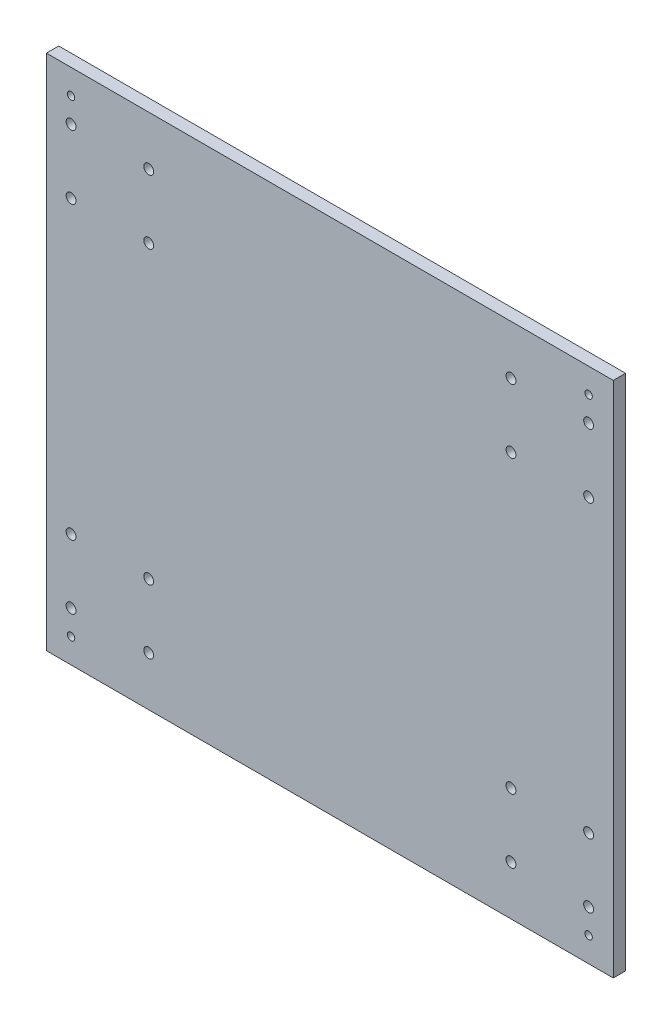
ISO-10303-21;
HEADER;
FILE_DESCRIPTION(('STEP AP214'),'2;1');
FILE_NAME('part.step','',(''),(''),'','','');
FILE_SCHEMA(('AUTOMOTIVE_DESIGN { 1 0 10303 214 1 1 1 1 }'));
ENDSEC;
DATA;
#1=APPLICATION_CONTEXT('core data for automotive mechanical design processes');
#2=APPLICATION_PROTOCOL_DEFINITION('international standard','automotive_design',2000,#1);
#3=PRODUCT_CONTEXT('',#1,'mechanical');
#4=PRODUCT('Part','Part','',(#3));
#5=PRODUCT_RELATED_PRODUCT_CATEGORY('part','',(#4));
#6=PRODUCT_DEFINITION_FORMATION('','',#4);
#7=PRODUCT_DEFINITION_CONTEXT('part definition',#1,'design');
#8=PRODUCT_DEFINITION('design','',#6,#7);
#9=PRODUCT_DEFINITION_SHAPE('','',#8);
#10=(LENGTH_UNIT() NAMED_UNIT(*) SI_UNIT(.MILLI.,.METRE.));
#11=(NAMED_UNIT(*) PLANE_ANGLE_UNIT() SI_UNIT($,.RADIAN.));
#12=(NAMED_UNIT(*) SI_UNIT($,.STERADIAN.) SOLID_ANGLE_UNIT());
#13=UNCERTAINTY_MEASURE_WITH_UNIT(LENGTH_MEASURE(1.E-05),#10,'distance_accuracy_value','');
#14=(GEOMETRIC_REPRESENTATION_CONTEXT(3) GLOBAL_UNCERTAINTY_ASSIGNED_CONTEXT((#13)) GLOBAL_UNIT_ASSIGNED_CONTEXT((#10,
#11,#12)) REPRESENTATION_CONTEXT('',''));
#15=CARTESIAN_POINT('',(0.,0.,0.));
#16=DIRECTION('',(0.,0.,1.));
#17=DIRECTION('',(1.,0.,0.));
#18=AXIS2_PLACEMENT_3D('',#15,#16,#17);
#19=CARTESIAN_POINT('',(0.,0.,5.));
#20=DIRECTION('',(0.,0.,-1.));
#21=DIRECTION('',(-1.,0.,0.));
#22=AXIS2_PLACEMENT_3D('',#19,#20,#21);
#23=PLANE('',#22);
#24=DIRECTION('',(0.,1.,0.));
#25=VECTOR('',#24,1.);
#26=CARTESIAN_POINT('',(115.,-105.,5.));
#27=LINE('',#26,#25);
#28=CARTESIAN_POINT('',(115.,-105.,5.));
#29=VERTEX_POINT('',#28);
#30=CARTESIAN_POINT('',(115.,105.,5.));
#31=VERTEX_POINT('',#30);
#32=EDGE_CURVE('E89',#29,#31,#27,.T.);
#33=ORIENTED_EDGE('',*,*,#32,.T.);
#34=DIRECTION('',(-1.,0.,0.));
#35=VECTOR('',#34,1.);
#36=CARTESIAN_POINT('',(-115.,105.,5.));
#37=LINE('',#36,#35);
#38=CARTESIAN_POINT('',(-115.,105.,5.));
#39=VERTEX_POINT('',#38);
#40=EDGE_CURVE('E84',#31,#39,#37,.T.);
#41=ORIENTED_EDGE('',*,*,#40,.T.);
#42=DIRECTION('',(0.,-1.,0.));
#43=VECTOR('',#42,1.);
#44=CARTESIAN_POINT('',(-115.,-105.,5.));
#45=LINE('',#44,#43);
#46=CARTESIAN_POINT('',(-115.,-105.,5.));
#47=VERTEX_POINT('',#46);
#48=EDGE_CURVE('E87',#39,#47,#45,.T.);
#49=ORIENTED_EDGE('',*,*,#48,.T.);
#50=DIRECTION('',(1.,0.,0.));
#51=VECTOR('',#50,1.);
#52=CARTESIAN_POINT('',(-115.,-105.,5.));
#53=LINE('',#52,#51);
#54=EDGE_CURVE('E54',#47,#29,#53,.T.);
#55=ORIENTED_EDGE('',*,*,#54,.T.);
#56=EDGE_LOOP('',(#33,#41,#49,#55));
#57=FACE_BOUND('',#56,.T.);
#58=CARTESIAN_POINT('',(-105.,85.,5.));
#59=DIRECTION('',(0.,0.,1.));
#60=DIRECTION('',(1.,0.,0.));
#61=AXIS2_PLACEMENT_3D('',#58,#59,#60);
#62=CIRCLE('',#61,2.);
#63=CARTESIAN_POINT('',(-103.,85.,5.));
#64=VERTEX_POINT('',#63);
#65=EDGE_CURVE('E104',#64,#64,#62,.T.);
#66=ORIENTED_EDGE('',*,*,#65,.F.);
#67=EDGE_LOOP('',(#66));
#68=FACE_BOUND('',#67,.T.);
#69=CARTESIAN_POINT('',(-73.5,85.,5.));
#70=DIRECTION('',(0.,0.,1.));
#71=DIRECTION('',(1.,0.,0.));
#72=AXIS2_PLACEMENT_3D('',#69,#70,#71);
#73=CIRCLE('',#72,2.);
#74=CARTESIAN_POINT('',(-71.5,85.,5.));
#75=VERTEX_POINT('',#74);
#76=EDGE_CURVE('E119',#75,#75,#73,.T.);
#77=ORIENTED_EDGE('',*,*,#76,.F.);
#78=EDGE_LOOP('',(#77));
#79=FACE_BOUND('',#78,.T.);
#80=CARTESIAN_POINT('',(-105.,59.,5.));
#81=DIRECTION('',(0.,0.,1.));
#82=DIRECTION('',(1.,0.,0.));
#83=AXIS2_PLACEMENT_3D('',#80,#81,#82);
#84=CIRCLE('',#83,2.);
#85=CARTESIAN_POINT('',(-103.,59.,5.));
#86=VERTEX_POINT('',#85);
#87=EDGE_CURVE('E125',#86,#86,#84,.T.);
#88=ORIENTED_EDGE('',*,*,#87,.F.);
#89=EDGE_LOOP('',(#88));
#90=FACE_BOUND('',#89,.T.);
#91=CARTESIAN_POINT('',(-73.5,59.,5.));
#92=DIRECTION('',(0.,0.,1.));
#93=DIRECTION('',(1.,0.,0.));
#94=AXIS2_PLACEMENT_3D('',#91,#92,#93);
#95=CIRCLE('',#94,2.);
#96=CARTESIAN_POINT('',(-71.5,59.,5.));
#97=VERTEX_POINT('',#96);
#98=EDGE_CURVE('E131',#97,#97,#95,.T.);
#99=ORIENTED_EDGE('',*,*,#98,.F.);
#100=EDGE_LOOP('',(#99));
#101=FACE_BOUND('',#100,.T.);
#102=CARTESIAN_POINT('',(-105.,95.,5.));
#103=DIRECTION('',(0.,0.,1.));
#104=DIRECTION('',(1.,0.,0.));
#105=AXIS2_PLACEMENT_3D('',#102,#103,#104);
#106=CIRCLE('',#105,1.5);
#107=CARTESIAN_POINT('',(-103.5,95.,5.));
#108=VERTEX_POINT('',#107);
#109=EDGE_CURVE('E137',#108,#108,#106,.T.);
#110=ORIENTED_EDGE('',*,*,#109,.F.);
#111=EDGE_LOOP('',(#110));
#112=FACE_BOUND('',#111,.T.);
#113=CARTESIAN_POINT('',(-105.,-59.,5.));
#114=DIRECTION('',(0.,0.,1.));
#115=DIRECTION('',(-1.,0.,0.));
#116=AXIS2_PLACEMENT_3D('',#113,#114,#115);
#117=CIRCLE('',#116,2.);
#118=CARTESIAN_POINT('',(-107.,-59.,5.));
#119=VERTEX_POINT('',#118);
#120=EDGE_CURVE('E143',#119,#119,#117,.T.);
#121=ORIENTED_EDGE('',*,*,#120,.F.);
#122=EDGE_LOOP('',(#121));
#123=FACE_BOUND('',#122,.T.);
#124=CARTESIAN_POINT('',(-105.,-85.,5.));
#125=DIRECTION('',(0.,0.,1.));
#126=DIRECTION('',(-1.,0.,0.));
#127=AXIS2_PLACEMENT_3D('',#124,#125,#126);
#128=CIRCLE('',#127,2.);
#129=CARTESIAN_POINT('',(-107.,-85.,5.));
#130=VERTEX_POINT('',#129);
#131=EDGE_CURVE('E149',#130,#130,#128,.T.);
#132=ORIENTED_EDGE('',*,*,#131,.F.);
#133=EDGE_LOOP('',(#132));
#134=FACE_BOUND('',#133,.T.);
#135=CARTESIAN_POINT('',(-105.,-95.,5.));
#136=DIRECTION('',(0.,0.,1.));
#137=DIRECTION('',(-1.,0.,0.));
#138=AXIS2_PLACEMENT_3D('',#135,#136,#137);
#139=CIRCLE('',#138,1.5);
#140=CARTESIAN_POINT('',(-106.5,-95.,5.));
#141=VERTEX_POINT('',#140);
#142=EDGE_CURVE('E155',#141,#141,#139,.T.);
#143=ORIENTED_EDGE('',*,*,#142,.F.);
#144=EDGE_LOOP('',(#143));
#145=FACE_BOUND('',#144,.T.);
#146=CARTESIAN_POINT('',(-73.5,-59.,5.));
#147=DIRECTION('',(0.,0.,1.));
#148=DIRECTION('',(-1.,0.,0.));
#149=AXIS2_PLACEMENT_3D('',#146,#147,#148);
#150=CIRCLE('',#149,2.);
#151=CARTESIAN_POINT('',(-75.5,-59.,5.));
#152=VERTEX_POINT('',#151);
#153=EDGE_CURVE('E161',#152,#152,#150,.T.);
#154=ORIENTED_EDGE('',*,*,#153,.F.);
#155=EDGE_LOOP('',(#154));
#156=FACE_BOUND('',#155,.T.);
#157=CARTESIAN_POINT('',(-73.5,-85.,5.));
#158=DIRECTION('',(0.,0.,1.));
#159=DIRECTION('',(-1.,0.,0.));
#160=AXIS2_PLACEMENT_3D('',#157,#158,#159);
#161=CIRCLE('',#160,2.);
#162=CARTESIAN_POINT('',(-75.5,-85.,5.));
#163=VERTEX_POINT('',#162);
#164=EDGE_CURVE('E167',#163,#163,#161,.T.);
#165=ORIENTED_EDGE('',*,*,#164,.F.);
#166=EDGE_LOOP('',(#165));
#167=FACE_BOUND('',#166,.T.);
#168=CARTESIAN_POINT('',(73.5,-85.,5.));
#169=DIRECTION('',(0.,0.,1.));
#170=DIRECTION('',(1.,0.,0.));
#171=AXIS2_PLACEMENT_3D('',#168,#169,#170);
#172=CIRCLE('',#171,2.);
#173=CARTESIAN_POINT('',(75.5,-85.,5.));
#174=VERTEX_POINT('',#173);
#175=EDGE_CURVE('E173',#174,#174,#172,.T.);
#176=ORIENTED_EDGE('',*,*,#175,.F.);
#177=EDGE_LOOP('',(#176));
#178=FACE_BOUND('',#177,.T.);
#179=CARTESIAN_POINT('',(73.5,-59.,5.));
#180=DIRECTION('',(0.,0.,1.));
#181=DIRECTION('',(1.,0.,0.));
#182=AXIS2_PLACEMENT_3D('',#179,#180,#181);
#183=CIRCLE('',#182,2.);
#184=CARTESIAN_POINT('',(75.5,-59.,5.));
#185=VERTEX_POINT('',#184);
#186=EDGE_CURVE('E179',#185,#185,#183,.T.);
#187=ORIENTED_EDGE('',*,*,#186,.F.);
#188=EDGE_LOOP('',(#187));
#189=FACE_BOUND('',#188,.T.);
#190=CARTESIAN_POINT('',(105.,-95.,5.));
#191=DIRECTION('',(0.,0.,1.));
#192=DIRECTION('',(1.,0.,0.));
#193=AXIS2_PLACEMENT_3D('',#190,#191,#192);
#194=CIRCLE('',#193,1.5);
#195=CARTESIAN_POINT('',(106.5,-95.,5.));
#196=VERTEX_POINT('',#195);
#197=EDGE_CURVE('E185',#196,#196,#194,.T.);
#198=ORIENTED_EDGE('',*,*,#197,.F.);
#199=EDGE_LOOP('',(#198));
#200=FACE_BOUND('',#199,.T.);
#201=CARTESIAN_POINT('',(105.,-85.,5.));
#202=DIRECTION('',(0.,0.,1.));
#203=DIRECTION('',(1.,0.,0.));
#204=AXIS2_PLACEMENT_3D('',#201,#202,#203);
#205=CIRCLE('',#204,2.);
#206=CARTESIAN_POINT('',(107.,-85.,5.));
#207=VERTEX_POINT('',#206);
#208=EDGE_CURVE('E191',#207,#207,#205,.T.);
#209=ORIENTED_EDGE('',*,*,#208,.F.);
#210=EDGE_LOOP('',(#209));
#211=FACE_BOUND('',#210,.T.);
#212=CARTESIAN_POINT('',(105.,-59.,5.));
#213=DIRECTION('',(0.,0.,1.));
#214=DIRECTION('',(1.,0.,0.));
#215=AXIS2_PLACEMENT_3D('',#212,#213,#214);
#216=CIRCLE('',#215,2.);
#217=CARTESIAN_POINT('',(107.,-59.,5.));
#218=VERTEX_POINT('',#217);
#219=EDGE_CURVE('E197',#218,#218,#216,.T.);
#220=ORIENTED_EDGE('',*,*,#219,.F.);
#221=EDGE_LOOP('',(#220));
#222=FACE_BOUND('',#221,.T.);
#223=CARTESIAN_POINT('',(105.,95.,5.));
#224=DIRECTION('',(0.,0.,1.));
#225=DIRECTION('',(-1.,0.,0.));
#226=AXIS2_PLACEMENT_3D('',#223,#224,#225);
#227=CIRCLE('',#226,1.5);
#228=CARTESIAN_POINT('',(103.5,95.,5.));
#229=VERTEX_POINT('',#228);
#230=EDGE_CURVE('E203',#229,#229,#227,.T.);
#231=ORIENTED_EDGE('',*,*,#230,.F.);
#232=EDGE_LOOP('',(#231));
#233=FACE_BOUND('',#232,.T.);
#234=CARTESIAN_POINT('',(73.5,59.,5.));
#235=DIRECTION('',(0.,0.,1.));
#236=DIRECTION('',(-1.,0.,0.));
#237=AXIS2_PLACEMENT_3D('',#234,#235,#236);
#238=CIRCLE('',#237,2.);
#239=CARTESIAN_POINT('',(71.5,59.,5.));
#240=VERTEX_POINT('',#239);
#241=EDGE_CURVE('E209',#240,#240,#238,.T.);
#242=ORIENTED_EDGE('',*,*,#241,.F.);
#243=EDGE_LOOP('',(#242));
#244=FACE_BOUND('',#243,.T.);
#245=CARTESIAN_POINT('',(105.,59.,5.));
#246=DIRECTION('',(0.,0.,1.));
#247=DIRECTION('',(-1.,0.,0.));
#248=AXIS2_PLACEMENT_3D('',#245,#246,#247);
#249=CIRCLE('',#248,2.);
#250=CARTESIAN_POINT('',(103.,59.,5.));
#251=VERTEX_POINT('',#250);
#252=EDGE_CURVE('E215',#251,#251,#249,.T.);
#253=ORIENTED_EDGE('',*,*,#252,.F.);
#254=EDGE_LOOP('',(#253));
#255=FACE_BOUND('',#254,.T.);
#256=CARTESIAN_POINT('',(73.5,85.,5.));
#257=DIRECTION('',(0.,0.,1.));
#258=DIRECTION('',(-1.,0.,0.));
#259=AXIS2_PLACEMENT_3D('',#256,#257,#258);
#260=CIRCLE('',#259,2.);
#261=CARTESIAN_POINT('',(71.5,85.,5.));
#262=VERTEX_POINT('',#261);
#263=EDGE_CURVE('E221',#262,#262,#260,.T.);
#264=ORIENTED_EDGE('',*,*,#263,.F.);
#265=EDGE_LOOP('',(#264));
#266=FACE_BOUND('',#265,.T.);
#267=CARTESIAN_POINT('',(105.,85.,5.));
#268=DIRECTION('',(0.,0.,1.));
#269=DIRECTION('',(-1.,0.,0.));
#270=AXIS2_PLACEMENT_3D('',#267,#268,#269);
#271=CIRCLE('',#270,2.);
#272=CARTESIAN_POINT('',(103.,85.,5.));
#273=VERTEX_POINT('',#272);
#274=EDGE_CURVE('E227',#273,#273,#271,.T.);
#275=ORIENTED_EDGE('',*,*,#274,.F.);
#276=EDGE_LOOP('',(#275));
#277=FACE_BOUND('',#276,.T.);
#278=ADVANCED_FACE('F37',(#57,#68,#79,#90,#101,#112,#123,#134,#145,#156,#167,#178,#189,#200,
#211,#222,#233,#244,#255,#266,#277),#23,.F.);
#279=CARTESIAN_POINT('',(0.,0.,0.));
#280=DIRECTION('',(0.,0.,-1.));
#281=DIRECTION('',(-1.,0.,0.));
#282=AXIS2_PLACEMENT_3D('',#279,#280,#281);
#283=PLANE('',#282);
#284=CARTESIAN_POINT('',(73.5,85.,0.));
#285=DIRECTION('',(0.,0.,1.));
#286=DIRECTION('',(-1.,0.,0.));
#287=AXIS2_PLACEMENT_3D('',#284,#285,#286);
#288=CIRCLE('',#287,2.);
#289=CARTESIAN_POINT('',(71.5,85.,0.));
#290=VERTEX_POINT('',#289);
#291=EDGE_CURVE('E224',#290,#290,#288,.T.);
#292=ORIENTED_EDGE('',*,*,#291,.T.);
#293=EDGE_LOOP('',(#292));
#294=FACE_BOUND('',#293,.T.);
#295=CARTESIAN_POINT('',(73.5,59.,0.));
#296=DIRECTION('',(0.,0.,1.));
#297=DIRECTION('',(-1.,0.,0.));
#298=AXIS2_PLACEMENT_3D('',#295,#296,#297);
#299=CIRCLE('',#298,2.);
#300=CARTESIAN_POINT('',(71.5,59.,0.));
#301=VERTEX_POINT('',#300);
#302=EDGE_CURVE('E212',#301,#301,#299,.T.);
#303=ORIENTED_EDGE('',*,*,#302,.T.);
#304=EDGE_LOOP('',(#303));
#305=FACE_BOUND('',#304,.T.);
#306=CARTESIAN_POINT('',(105.,-59.,0.));
#307=DIRECTION('',(0.,0.,1.));
#308=DIRECTION('',(1.,0.,0.));
#309=AXIS2_PLACEMENT_3D('',#306,#307,#308);
#310=CIRCLE('',#309,2.);
#311=CARTESIAN_POINT('',(107.,-59.,0.));
#312=VERTEX_POINT('',#311);
#313=EDGE_CURVE('E200',#312,#312,#310,.T.);
#314=ORIENTED_EDGE('',*,*,#313,.T.);
#315=EDGE_LOOP('',(#314));
#316=FACE_BOUND('',#315,.T.);
#317=CARTESIAN_POINT('',(105.,-95.,0.));
#318=DIRECTION('',(0.,0.,1.));
#319=DIRECTION('',(1.,0.,0.));
#320=AXIS2_PLACEMENT_3D('',#317,#318,#319);
#321=CIRCLE('',#320,1.5);
#322=CARTESIAN_POINT('',(106.5,-95.,0.));
#323=VERTEX_POINT('',#322);
#324=EDGE_CURVE('E188',#323,#323,#321,.T.);
#325=ORIENTED_EDGE('',*,*,#324,.T.);
#326=EDGE_LOOP('',(#325));
#327=FACE_BOUND('',#326,.T.);
#328=CARTESIAN_POINT('',(73.5,-85.,0.));
#329=DIRECTION('',(0.,0.,1.));
#330=DIRECTION('',(1.,0.,0.));
#331=AXIS2_PLACEMENT_3D('',#328,#329,#330);
#332=CIRCLE('',#331,2.);
#333=CARTESIAN_POINT('',(75.5,-85.,0.));
#334=VERTEX_POINT('',#333);
#335=EDGE_CURVE('E176',#334,#334,#332,.T.);
#336=ORIENTED_EDGE('',*,*,#335,.T.);
#337=EDGE_LOOP('',(#336));
#338=FACE_BOUND('',#337,.T.);
#339=CARTESIAN_POINT('',(-73.5,-59.,0.));
#340=DIRECTION('',(0.,0.,1.));
#341=DIRECTION('',(-1.,0.,0.));
#342=AXIS2_PLACEMENT_3D('',#339,#340,#341);
#343=CIRCLE('',#342,2.);
#344=CARTESIAN_POINT('',(-75.5,-59.,0.));
#345=VERTEX_POINT('',#344);
#346=EDGE_CURVE('E164',#345,#345,#343,.T.);
#347=ORIENTED_EDGE('',*,*,#346,.T.);
#348=EDGE_LOOP('',(#347));
#349=FACE_BOUND('',#348,.T.);
#350=CARTESIAN_POINT('',(-105.,-85.,0.));
#351=DIRECTION('',(0.,0.,1.));
#352=DIRECTION('',(-1.,0.,0.));
#353=AXIS2_PLACEMENT_3D('',#350,#351,#352);
#354=CIRCLE('',#353,2.);
#355=CARTESIAN_POINT('',(-107.,-85.,0.));
#356=VERTEX_POINT('',#355);
#357=EDGE_CURVE('E152',#356,#356,#354,.T.);
#358=ORIENTED_EDGE('',*,*,#357,.T.);
#359=EDGE_LOOP('',(#358));
#360=FACE_BOUND('',#359,.T.);
#361=CARTESIAN_POINT('',(-105.,95.,0.));
#362=DIRECTION('',(0.,0.,1.));
#363=DIRECTION('',(1.,0.,0.));
#364=AXIS2_PLACEMENT_3D('',#361,#362,#363);
#365=CIRCLE('',#364,1.5);
#366=CARTESIAN_POINT('',(-103.5,95.,0.));
#367=VERTEX_POINT('',#366);
#368=EDGE_CURVE('E140',#367,#367,#365,.T.);
#369=ORIENTED_EDGE('',*,*,#368,.T.);
#370=EDGE_LOOP('',(#369));
#371=FACE_BOUND('',#370,.T.);
#372=CARTESIAN_POINT('',(-105.,59.,0.));
#373=DIRECTION('',(0.,0.,1.));
#374=DIRECTION('',(1.,0.,0.));
#375=AXIS2_PLACEMENT_3D('',#372,#373,#374);
#376=CIRCLE('',#375,2.);
#377=CARTESIAN_POINT('',(-103.,59.,0.));
#378=VERTEX_POINT('',#377);
#379=EDGE_CURVE('E128',#378,#378,#376,.T.);
#380=ORIENTED_EDGE('',*,*,#379,.T.);
#381=EDGE_LOOP('',(#380));
#382=FACE_BOUND('',#381,.T.);
#383=CARTESIAN_POINT('',(-105.,85.,0.));
#384=DIRECTION('',(0.,0.,1.));
#385=DIRECTION('',(1.,0.,0.));
#386=AXIS2_PLACEMENT_3D('',#383,#384,#385);
#387=CIRCLE('',#386,2.);
#388=CARTESIAN_POINT('',(-103.,85.,0.));
#389=VERTEX_POINT('',#388);
#390=EDGE_CURVE('E116',#389,#389,#387,.T.);
#391=ORIENTED_EDGE('',*,*,#390,.T.);
#392=EDGE_LOOP('',(#391));
#393=FACE_BOUND('',#392,.T.);
#394=DIRECTION('',(0.,1.,0.));
#395=VECTOR('',#394,1.);
#396=CARTESIAN_POINT('',(115.,-105.,0.));
#397=LINE('',#396,#395);
#398=CARTESIAN_POINT('',(115.,-105.,0.));
#399=VERTEX_POINT('',#398);
#400=CARTESIAN_POINT('',(115.,105.,0.));
#401=VERTEX_POINT('',#400);
#402=EDGE_CURVE('E101',#399,#401,#397,.T.);
#403=ORIENTED_EDGE('',*,*,#402,.F.);
#404=DIRECTION('',(1.,0.,0.));
#405=VECTOR('',#404,1.);
#406=CARTESIAN_POINT('',(-115.,-105.,0.));
#407=LINE('',#406,#405);
#408=CARTESIAN_POINT('',(-115.,-105.,0.));
#409=VERTEX_POINT('',#408);
#410=EDGE_CURVE('E77',#409,#399,#407,.T.);
#411=ORIENTED_EDGE('',*,*,#410,.F.);
#412=DIRECTION('',(0.,-1.,0.));
#413=VECTOR('',#412,1.);
#414=CARTESIAN_POINT('',(-115.,-105.,0.));
#415=LINE('',#414,#413);
#416=CARTESIAN_POINT('',(-115.,105.,0.));
#417=VERTEX_POINT('',#416);
#418=EDGE_CURVE('E71',#417,#409,#415,.T.);
#419=ORIENTED_EDGE('',*,*,#418,.F.);
#420=DIRECTION('',(-1.,0.,0.));
#421=VECTOR('',#420,1.);
#422=CARTESIAN_POINT('',(-115.,105.,0.));
#423=LINE('',#422,#421);
#424=EDGE_CURVE('E93',#401,#417,#423,.T.);
#425=ORIENTED_EDGE('',*,*,#424,.F.);
#426=EDGE_LOOP('',(#403,#411,#419,#425));
#427=FACE_BOUND('',#426,.T.);
#428=CARTESIAN_POINT('',(-73.5,85.,0.));
#429=DIRECTION('',(0.,0.,1.));
#430=DIRECTION('',(1.,0.,0.));
#431=AXIS2_PLACEMENT_3D('',#428,#429,#430);
#432=CIRCLE('',#431,2.);
#433=CARTESIAN_POINT('',(-71.5,85.,0.));
#434=VERTEX_POINT('',#433);
#435=EDGE_CURVE('E122',#434,#434,#432,.T.);
#436=ORIENTED_EDGE('',*,*,#435,.T.);
#437=EDGE_LOOP('',(#436));
#438=FACE_BOUND('',#437,.T.);
#439=CARTESIAN_POINT('',(-73.5,59.,0.));
#440=DIRECTION('',(0.,0.,1.));
#441=DIRECTION('',(1.,0.,0.));
#442=AXIS2_PLACEMENT_3D('',#439,#440,#441);
#443=CIRCLE('',#442,2.);
#444=CARTESIAN_POINT('',(-71.5,59.,0.));
#445=VERTEX_POINT('',#444);
#446=EDGE_CURVE('E134',#445,#445,#443,.T.);
#447=ORIENTED_EDGE('',*,*,#446,.T.);
#448=EDGE_LOOP('',(#447));
#449=FACE_BOUND('',#448,.T.);
#450=CARTESIAN_POINT('',(-105.,-59.,0.));
#451=DIRECTION('',(0.,0.,1.));
#452=DIRECTION('',(-1.,0.,0.));
#453=AXIS2_PLACEMENT_3D('',#450,#451,#452);
#454=CIRCLE('',#453,2.);
#455=CARTESIAN_POINT('',(-107.,-59.,0.));
#456=VERTEX_POINT('',#455);
#457=EDGE_CURVE('E146',#456,#456,#454,.T.);
#458=ORIENTED_EDGE('',*,*,#457,.T.);
#459=EDGE_LOOP('',(#458));
#460=FACE_BOUND('',#459,.T.);
#461=CARTESIAN_POINT('',(-105.,-95.,0.));
#462=DIRECTION('',(0.,0.,1.));
#463=DIRECTION('',(-1.,0.,0.));
#464=AXIS2_PLACEMENT_3D('',#461,#462,#463);
#465=CIRCLE('',#464,1.5);
#466=CARTESIAN_POINT('',(-106.5,-95.,0.));
#467=VERTEX_POINT('',#466);
#468=EDGE_CURVE('E158',#467,#467,#465,.T.);
#469=ORIENTED_EDGE('',*,*,#468,.T.);
#470=EDGE_LOOP('',(#469));
#471=FACE_BOUND('',#470,.T.);
#472=CARTESIAN_POINT('',(-73.5,-85.,0.));
#473=DIRECTION('',(0.,0.,1.));
#474=DIRECTION('',(-1.,0.,0.));
#475=AXIS2_PLACEMENT_3D('',#472,#473,#474);
#476=CIRCLE('',#475,2.);
#477=CARTESIAN_POINT('',(-75.5,-85.,0.));
#478=VERTEX_POINT('',#477);
#479=EDGE_CURVE('E170',#478,#478,#476,.T.);
#480=ORIENTED_EDGE('',*,*,#479,.T.);
#481=EDGE_LOOP('',(#480));
#482=FACE_BOUND('',#481,.T.);
#483=CARTESIAN_POINT('',(73.5,-59.,0.));
#484=DIRECTION('',(0.,0.,1.));
#485=DIRECTION('',(1.,0.,0.));
#486=AXIS2_PLACEMENT_3D('',#483,#484,#485);
#487=CIRCLE('',#486,2.);
#488=CARTESIAN_POINT('',(75.5,-59.,0.));
#489=VERTEX_POINT('',#488);
#490=EDGE_CURVE('E182',#489,#489,#487,.T.);
#491=ORIENTED_EDGE('',*,*,#490,.T.);
#492=EDGE_LOOP('',(#491));
#493=FACE_BOUND('',#492,.T.);
#494=CARTESIAN_POINT('',(105.,-85.,0.));
#495=DIRECTION('',(0.,0.,1.));
#496=DIRECTION('',(1.,0.,0.));
#497=AXIS2_PLACEMENT_3D('',#494,#495,#496);
#498=CIRCLE('',#497,2.);
#499=CARTESIAN_POINT('',(107.,-85.,0.));
#500=VERTEX_POINT('',#499);
#501=EDGE_CURVE('E194',#500,#500,#498,.T.);
#502=ORIENTED_EDGE('',*,*,#501,.T.);
#503=EDGE_LOOP('',(#502));
#504=FACE_BOUND('',#503,.T.);
#505=CARTESIAN_POINT('',(105.,95.,0.));
#506=DIRECTION('',(0.,0.,1.));
#507=DIRECTION('',(-1.,0.,0.));
#508=AXIS2_PLACEMENT_3D('',#505,#506,#507);
#509=CIRCLE('',#508,1.5);
#510=CARTESIAN_POINT('',(103.5,95.,0.));
#511=VERTEX_POINT('',#510);
#512=EDGE_CURVE('E206',#511,#511,#509,.T.);
#513=ORIENTED_EDGE('',*,*,#512,.T.);
#514=EDGE_LOOP('',(#513));
#515=FACE_BOUND('',#514,.T.);
#516=CARTESIAN_POINT('',(105.,59.,0.));
#517=DIRECTION('',(0.,0.,1.));
#518=DIRECTION('',(-1.,0.,0.));
#519=AXIS2_PLACEMENT_3D('',#516,#517,#518);
#520=CIRCLE('',#519,2.);
#521=CARTESIAN_POINT('',(103.,59.,0.));
#522=VERTEX_POINT('',#521);
#523=EDGE_CURVE('E218',#522,#522,#520,.T.);
#524=ORIENTED_EDGE('',*,*,#523,.T.);
#525=EDGE_LOOP('',(#524));
#526=FACE_BOUND('',#525,.T.);
#527=CARTESIAN_POINT('',(105.,85.,0.));
#528=DIRECTION('',(0.,0.,1.));
#529=DIRECTION('',(-1.,0.,0.));
#530=AXIS2_PLACEMENT_3D('',#527,#528,#529);
#531=CIRCLE('',#530,2.);
#532=CARTESIAN_POINT('',(103.,85.,0.));
#533=VERTEX_POINT('',#532);
#534=EDGE_CURVE('E230',#533,#533,#531,.T.);
#535=ORIENTED_EDGE('',*,*,#534,.T.);
#536=EDGE_LOOP('',(#535));
#537=FACE_BOUND('',#536,.T.);
#538=ADVANCED_FACE('F112',(#294,#305,#316,#327,#338,#349,#360,#371,#382,#393,#427,#438,#449,
#460,#471,#482,#493,#504,#515,#526,#537),#283,.T.);
#539=CARTESIAN_POINT('',(115.,-105.,5.));
#540=DIRECTION('',(-1.,0.,0.));
#541=DIRECTION('',(0.,0.,1.));
#542=AXIS2_PLACEMENT_3D('',#539,#540,#541);
#543=PLANE('',#542);
#544=ORIENTED_EDGE('',*,*,#402,.T.);
#545=DIRECTION('',(0.,0.,-1.));
#546=VECTOR('',#545,1.);
#547=CARTESIAN_POINT('',(115.,105.,5.));
#548=LINE('',#547,#546);
#549=EDGE_CURVE('E11',#31,#401,#548,.T.);
#550=ORIENTED_EDGE('',*,*,#549,.F.);
#551=ORIENTED_EDGE('',*,*,#32,.F.);
#552=DIRECTION('',(0.,0.,-1.));
#553=VECTOR('',#552,1.);
#554=CARTESIAN_POINT('',(115.,-105.,5.));
#555=LINE('',#554,#553);
#556=EDGE_CURVE('E97',#29,#399,#555,.T.);
#557=ORIENTED_EDGE('',*,*,#556,.T.);
#558=EDGE_LOOP('',(#544,#550,#551,#557));
#559=FACE_BOUND('',#558,.T.);
#560=ADVANCED_FACE('F39',(#559),#543,.F.);
#561=CARTESIAN_POINT('',(-115.,105.,5.));
#562=DIRECTION('',(0.,-1.,0.));
#563=DIRECTION('',(0.,0.,-1.));
#564=AXIS2_PLACEMENT_3D('',#561,#562,#563);
#565=PLANE('',#564);
#566=ORIENTED_EDGE('',*,*,#424,.T.);
#567=DIRECTION('',(0.,0.,-1.));
#568=VECTOR('',#567,1.);
#569=CARTESIAN_POINT('',(-115.,105.,5.));
#570=LINE('',#569,#568);
#571=EDGE_CURVE('E46',#39,#417,#570,.T.);
#572=ORIENTED_EDGE('',*,*,#571,.F.);
#573=ORIENTED_EDGE('',*,*,#40,.F.);
#574=ORIENTED_EDGE('',*,*,#549,.T.);
#575=EDGE_LOOP('',(#566,#572,#573,#574));
#576=FACE_BOUND('',#575,.T.);
#577=ADVANCED_FACE('F92',(#576),#565,.F.);
#578=CARTESIAN_POINT('',(-115.,-105.,5.));
#579=DIRECTION('',(1.,0.,0.));
#580=DIRECTION('',(0.,0.,-1.));
#581=AXIS2_PLACEMENT_3D('',#578,#579,#580);
#582=PLANE('',#581);
#583=ORIENTED_EDGE('',*,*,#418,.T.);
#584=DIRECTION('',(0.,0.,-1.));
#585=VECTOR('',#584,1.);
#586=CARTESIAN_POINT('',(-115.,-105.,5.));
#587=LINE('',#586,#585);
#588=EDGE_CURVE('E94',#47,#409,#587,.T.);
#589=ORIENTED_EDGE('',*,*,#588,.F.);
#590=ORIENTED_EDGE('',*,*,#48,.F.);
#591=ORIENTED_EDGE('',*,*,#571,.T.);
#592=EDGE_LOOP('',(#583,#589,#590,#591));
#593=FACE_BOUND('',#592,.T.);
#594=ADVANCED_FACE('F95',(#593),#582,.F.);
#595=CARTESIAN_POINT('',(-115.,-105.,5.));
#596=DIRECTION('',(0.,1.,0.));
#597=DIRECTION('',(0.,0.,1.));
#598=AXIS2_PLACEMENT_3D('',#595,#596,#597);
#599=PLANE('',#598);
#600=ORIENTED_EDGE('',*,*,#410,.T.);
#601=ORIENTED_EDGE('',*,*,#556,.F.);
#602=ORIENTED_EDGE('',*,*,#54,.F.);
#603=ORIENTED_EDGE('',*,*,#588,.T.);
#604=EDGE_LOOP('',(#600,#601,#602,#603));
#605=FACE_BOUND('',#604,.T.);
#606=ADVANCED_FACE('F109',(#605),#599,.F.);
#607=CARTESIAN_POINT('',(-105.,85.,5.));
#608=DIRECTION('',(0.,0.,-1.));
#609=DIRECTION('',(-1.,0.,0.));
#610=AXIS2_PLACEMENT_3D('',#607,#608,#609);
#611=CYLINDRICAL_SURFACE('',#610,2.);
#612=ORIENTED_EDGE('',*,*,#65,.T.);
#613=EDGE_LOOP('',(#612));
#614=FACE_BOUND('',#613,.T.);
#615=ORIENTED_EDGE('',*,*,#390,.F.);
#616=EDGE_LOOP('',(#615));
#617=FACE_BOUND('',#616,.T.);
#618=ADVANCED_FACE('F247',(#614,#617),#611,.F.);
#619=CARTESIAN_POINT('',(-73.5,85.,5.));
#620=DIRECTION('',(0.,0.,-1.));
#621=DIRECTION('',(-1.,0.,0.));
#622=AXIS2_PLACEMENT_3D('',#619,#620,#621);
#623=CYLINDRICAL_SURFACE('',#622,2.);
#624=ORIENTED_EDGE('',*,*,#76,.T.);
#625=EDGE_LOOP('',(#624));
#626=FACE_BOUND('',#625,.T.);
#627=ORIENTED_EDGE('',*,*,#435,.F.);
#628=EDGE_LOOP('',(#627));
#629=FACE_BOUND('',#628,.T.);
#630=ADVANCED_FACE('F293',(#626,#629),#623,.F.);
#631=CARTESIAN_POINT('',(-105.,59.,5.));
#632=DIRECTION('',(0.,0.,-1.));
#633=DIRECTION('',(-1.,0.,0.));
#634=AXIS2_PLACEMENT_3D('',#631,#632,#633);
#635=CYLINDRICAL_SURFACE('',#634,2.);
#636=ORIENTED_EDGE('',*,*,#87,.T.);
#637=EDGE_LOOP('',(#636));
#638=FACE_BOUND('',#637,.T.);
#639=ORIENTED_EDGE('',*,*,#379,.F.);
#640=EDGE_LOOP('',(#639));
#641=FACE_BOUND('',#640,.T.);
#642=ADVANCED_FACE('F301',(#638,#641),#635,.F.);
#643=CARTESIAN_POINT('',(-73.5,59.,5.));
#644=DIRECTION('',(0.,0.,-1.));
#645=DIRECTION('',(-1.,0.,0.));
#646=AXIS2_PLACEMENT_3D('',#643,#644,#645);
#647=CYLINDRICAL_SURFACE('',#646,2.);
#648=ORIENTED_EDGE('',*,*,#98,.T.);
#649=EDGE_LOOP('',(#648));
#650=FACE_BOUND('',#649,.T.);
#651=ORIENTED_EDGE('',*,*,#446,.F.);
#652=EDGE_LOOP('',(#651));
#653=FACE_BOUND('',#652,.T.);
#654=ADVANCED_FACE('F309',(#650,#653),#647,.F.);
#655=CARTESIAN_POINT('',(-105.,95.,5.));
#656=DIRECTION('',(0.,0.,-1.));
#657=DIRECTION('',(-1.,0.,0.));
#658=AXIS2_PLACEMENT_3D('',#655,#656,#657);
#659=CYLINDRICAL_SURFACE('',#658,1.5);
#660=ORIENTED_EDGE('',*,*,#109,.T.);
#661=EDGE_LOOP('',(#660));
#662=FACE_BOUND('',#661,.T.);
#663=ORIENTED_EDGE('',*,*,#368,.F.);
#664=EDGE_LOOP('',(#663));
#665=FACE_BOUND('',#664,.T.);
#666=ADVANCED_FACE('F318',(#662,#665),#659,.F.);
#667=CARTESIAN_POINT('',(-105.,-59.,5.));
#668=DIRECTION('',(0.,0.,-1.));
#669=DIRECTION('',(-1.,0.,0.));
#670=AXIS2_PLACEMENT_3D('',#667,#668,#669);
#671=CYLINDRICAL_SURFACE('',#670,2.);
#672=ORIENTED_EDGE('',*,*,#120,.T.);
#673=EDGE_LOOP('',(#672));
#674=FACE_BOUND('',#673,.T.);
#675=ORIENTED_EDGE('',*,*,#457,.F.);
#676=EDGE_LOOP('',(#675));
#677=FACE_BOUND('',#676,.T.);
#678=ADVANCED_FACE('F327',(#674,#677),#671,.F.);
#679=CARTESIAN_POINT('',(-105.,-85.,5.));
#680=DIRECTION('',(0.,0.,-1.));
#681=DIRECTION('',(-1.,0.,0.));
#682=AXIS2_PLACEMENT_3D('',#679,#680,#681);
#683=CYLINDRICAL_SURFACE('',#682,2.);
#684=ORIENTED_EDGE('',*,*,#131,.T.);
#685=EDGE_LOOP('',(#684));
#686=FACE_BOUND('',#685,.T.);
#687=ORIENTED_EDGE('',*,*,#357,.F.);
#688=EDGE_LOOP('',(#687));
#689=FACE_BOUND('',#688,.T.);
#690=ADVANCED_FACE('F336',(#686,#689),#683,.F.);
#691=CARTESIAN_POINT('',(-105.,-95.,5.));
#692=DIRECTION('',(0.,0.,-1.));
#693=DIRECTION('',(-1.,0.,0.));
#694=AXIS2_PLACEMENT_3D('',#691,#692,#693);
#695=CYLINDRICAL_SURFACE('',#694,1.5);
#696=ORIENTED_EDGE('',*,*,#142,.T.);
#697=EDGE_LOOP('',(#696));
#698=FACE_BOUND('',#697,.T.);
#699=ORIENTED_EDGE('',*,*,#468,.F.);
#700=EDGE_LOOP('',(#699));
#701=FACE_BOUND('',#700,.T.);
#702=ADVANCED_FACE('F345',(#698,#701),#695,.F.);
#703=CARTESIAN_POINT('',(-73.5,-59.,5.));
#704=DIRECTION('',(0.,0.,-1.));
#705=DIRECTION('',(-1.,0.,0.));
#706=AXIS2_PLACEMENT_3D('',#703,#704,#705);
#707=CYLINDRICAL_SURFACE('',#706,2.);
#708=ORIENTED_EDGE('',*,*,#153,.T.);
#709=EDGE_LOOP('',(#708));
#710=FACE_BOUND('',#709,.T.);
#711=ORIENTED_EDGE('',*,*,#346,.F.);
#712=EDGE_LOOP('',(#711));
#713=FACE_BOUND('',#712,.T.);
#714=ADVANCED_FACE('F354',(#710,#713),#707,.F.);
#715=CARTESIAN_POINT('',(-73.5,-85.,5.));
#716=DIRECTION('',(0.,0.,-1.));
#717=DIRECTION('',(-1.,0.,0.));
#718=AXIS2_PLACEMENT_3D('',#715,#716,#717);
#719=CYLINDRICAL_SURFACE('',#718,2.);
#720=ORIENTED_EDGE('',*,*,#164,.T.);
#721=EDGE_LOOP('',(#720));
#722=FACE_BOUND('',#721,.T.);
#723=ORIENTED_EDGE('',*,*,#479,.F.);
#724=EDGE_LOOP('',(#723));
#725=FACE_BOUND('',#724,.T.);
#726=ADVANCED_FACE('F363',(#722,#725),#719,.F.);
#727=CARTESIAN_POINT('',(73.5,-85.,5.));
#728=DIRECTION('',(0.,0.,-1.));
#729=DIRECTION('',(-1.,0.,0.));
#730=AXIS2_PLACEMENT_3D('',#727,#728,#729);
#731=CYLINDRICAL_SURFACE('',#730,2.);
#732=ORIENTED_EDGE('',*,*,#175,.T.);
#733=EDGE_LOOP('',(#732));
#734=FACE_BOUND('',#733,.T.);
#735=ORIENTED_EDGE('',*,*,#335,.F.);
#736=EDGE_LOOP('',(#735));
#737=FACE_BOUND('',#736,.T.);
#738=ADVANCED_FACE('F372',(#734,#737),#731,.F.);
#739=CARTESIAN_POINT('',(73.5,-59.,5.));
#740=DIRECTION('',(0.,0.,-1.));
#741=DIRECTION('',(-1.,0.,0.));
#742=AXIS2_PLACEMENT_3D('',#739,#740,#741);
#743=CYLINDRICAL_SURFACE('',#742,2.);
#744=ORIENTED_EDGE('',*,*,#186,.T.);
#745=EDGE_LOOP('',(#744));
#746=FACE_BOUND('',#745,.T.);
#747=ORIENTED_EDGE('',*,*,#490,.F.);
#748=EDGE_LOOP('',(#747));
#749=FACE_BOUND('',#748,.T.);
#750=ADVANCED_FACE('F381',(#746,#749),#743,.F.);
#751=CARTESIAN_POINT('',(105.,-95.,5.));
#752=DIRECTION('',(0.,0.,-1.));
#753=DIRECTION('',(-1.,0.,0.));
#754=AXIS2_PLACEMENT_3D('',#751,#752,#753);
#755=CYLINDRICAL_SURFACE('',#754,1.5);
#756=ORIENTED_EDGE('',*,*,#197,.T.);
#757=EDGE_LOOP('',(#756));
#758=FACE_BOUND('',#757,.T.);
#759=ORIENTED_EDGE('',*,*,#324,.F.);
#760=EDGE_LOOP('',(#759));
#761=FACE_BOUND('',#760,.T.);
#762=ADVANCED_FACE('F390',(#758,#761),#755,.F.);
#763=CARTESIAN_POINT('',(105.,-85.,5.));
#764=DIRECTION('',(0.,0.,-1.));
#765=DIRECTION('',(-1.,0.,0.));
#766=AXIS2_PLACEMENT_3D('',#763,#764,#765);
#767=CYLINDRICAL_SURFACE('',#766,2.);
#768=ORIENTED_EDGE('',*,*,#208,.T.);
#769=EDGE_LOOP('',(#768));
#770=FACE_BOUND('',#769,.T.);
#771=ORIENTED_EDGE('',*,*,#501,.F.);
#772=EDGE_LOOP('',(#771));
#773=FACE_BOUND('',#772,.T.);
#774=ADVANCED_FACE('F399',(#770,#773),#767,.F.);
#775=CARTESIAN_POINT('',(105.,-59.,5.));
#776=DIRECTION('',(0.,0.,-1.));
#777=DIRECTION('',(-1.,0.,0.));
#778=AXIS2_PLACEMENT_3D('',#775,#776,#777);
#779=CYLINDRICAL_SURFACE('',#778,2.);
#780=ORIENTED_EDGE('',*,*,#219,.T.);
#781=EDGE_LOOP('',(#780));
#782=FACE_BOUND('',#781,.T.);
#783=ORIENTED_EDGE('',*,*,#313,.F.);
#784=EDGE_LOOP('',(#783));
#785=FACE_BOUND('',#784,.T.);
#786=ADVANCED_FACE('F408',(#782,#785),#779,.F.);
#787=CARTESIAN_POINT('',(105.,95.,5.));
#788=DIRECTION('',(0.,0.,-1.));
#789=DIRECTION('',(-1.,0.,0.));
#790=AXIS2_PLACEMENT_3D('',#787,#788,#789);
#791=CYLINDRICAL_SURFACE('',#790,1.5);
#792=ORIENTED_EDGE('',*,*,#230,.T.);
#793=EDGE_LOOP('',(#792));
#794=FACE_BOUND('',#793,.T.);
#795=ORIENTED_EDGE('',*,*,#512,.F.);
#796=EDGE_LOOP('',(#795));
#797=FACE_BOUND('',#796,.T.);
#798=ADVANCED_FACE('F417',(#794,#797),#791,.F.);
#799=CARTESIAN_POINT('',(73.5,59.,5.));
#800=DIRECTION('',(0.,0.,-1.));
#801=DIRECTION('',(-1.,0.,0.));
#802=AXIS2_PLACEMENT_3D('',#799,#800,#801);
#803=CYLINDRICAL_SURFACE('',#802,2.);
#804=ORIENTED_EDGE('',*,*,#241,.T.);
#805=EDGE_LOOP('',(#804));
#806=FACE_BOUND('',#805,.T.);
#807=ORIENTED_EDGE('',*,*,#302,.F.);
#808=EDGE_LOOP('',(#807));
#809=FACE_BOUND('',#808,.T.);
#810=ADVANCED_FACE('F426',(#806,#809),#803,.F.);
#811=CARTESIAN_POINT('',(105.,59.,5.));
#812=DIRECTION('',(0.,0.,-1.));
#813=DIRECTION('',(-1.,0.,0.));
#814=AXIS2_PLACEMENT_3D('',#811,#812,#813);
#815=CYLINDRICAL_SURFACE('',#814,2.);
#816=ORIENTED_EDGE('',*,*,#252,.T.);
#817=EDGE_LOOP('',(#816));
#818=FACE_BOUND('',#817,.T.);
#819=ORIENTED_EDGE('',*,*,#523,.F.);
#820=EDGE_LOOP('',(#819));
#821=FACE_BOUND('',#820,.T.);
#822=ADVANCED_FACE('F435',(#818,#821),#815,.F.);
#823=CARTESIAN_POINT('',(73.5,85.,5.));
#824=DIRECTION('',(0.,0.,-1.));
#825=DIRECTION('',(-1.,0.,0.));
#826=AXIS2_PLACEMENT_3D('',#823,#824,#825);
#827=CYLINDRICAL_SURFACE('',#826,2.);
#828=ORIENTED_EDGE('',*,*,#263,.T.);
#829=EDGE_LOOP('',(#828));
#830=FACE_BOUND('',#829,.T.);
#831=ORIENTED_EDGE('',*,*,#291,.F.);
#832=EDGE_LOOP('',(#831));
#833=FACE_BOUND('',#832,.T.);
#834=ADVANCED_FACE('F444',(#830,#833),#827,.F.);
#835=CARTESIAN_POINT('',(105.,85.,5.));
#836=DIRECTION('',(0.,0.,-1.));
#837=DIRECTION('',(-1.,0.,0.));
#838=AXIS2_PLACEMENT_3D('',#835,#836,#837);
#839=CYLINDRICAL_SURFACE('',#838,2.);
#840=ORIENTED_EDGE('',*,*,#274,.T.);
#841=EDGE_LOOP('',(#840));
#842=FACE_BOUND('',#841,.T.);
#843=ORIENTED_EDGE('',*,*,#534,.F.);
#844=EDGE_LOOP('',(#843));
#845=FACE_BOUND('',#844,.T.);
#846=ADVANCED_FACE('F236',(#842,#845),#839,.F.);
#847=CLOSED_SHELL('',(#278,#538,#560,#577,#594,#606,#618,#630,#642,#654,#666,#678,#690,#702,
#714,#726,#738,#750,#762,#774,#786,#798,#810,#822,#834,#846));
#848=MANIFOLD_SOLID_BREP('B2',#847);
#849=ADVANCED_BREP_SHAPE_REPRESENTATION('',(#18,#848),#14);
#850=SHAPE_DEFINITION_REPRESENTATION(#9,#849);
ENDSEC;
END-ISO-10303-21;
